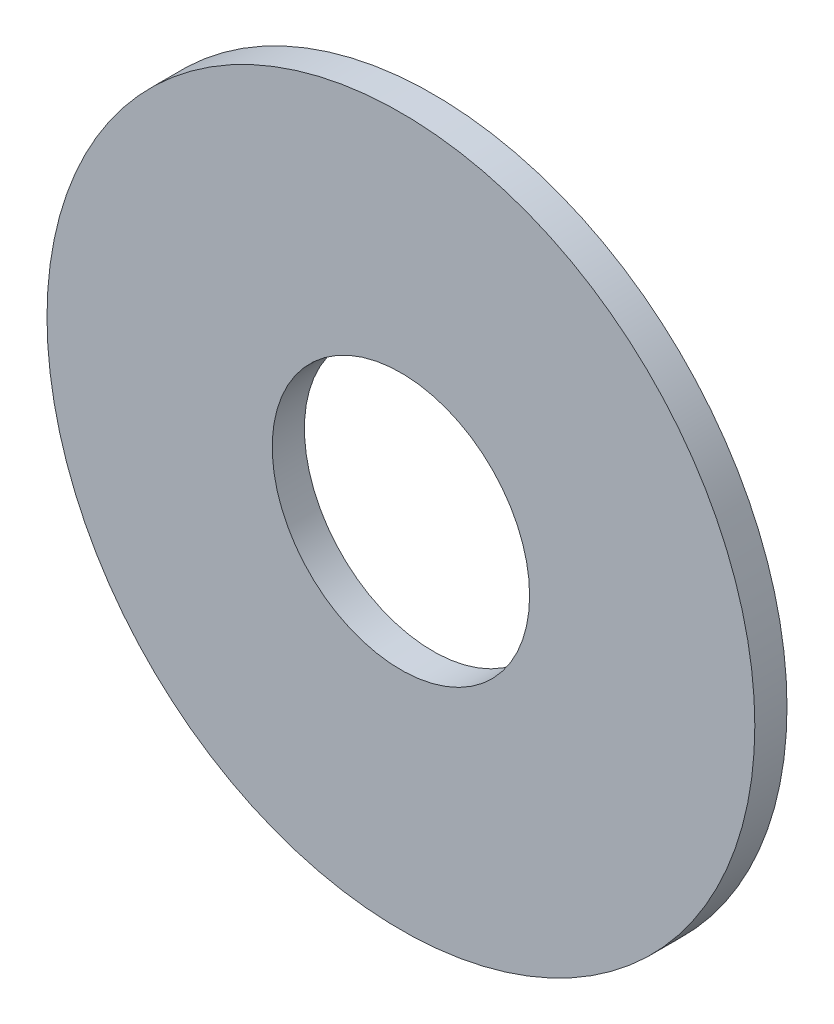
ISO-10303-21;
HEADER;
FILE_DESCRIPTION(('STEP AP214'),'2;1');
FILE_NAME('part.step','',(''),(''),'','','');
FILE_SCHEMA(('AUTOMOTIVE_DESIGN { 1 0 10303 214 1 1 1 1 }'));
ENDSEC;
DATA;
#1=APPLICATION_CONTEXT('core data for automotive mechanical design processes');
#2=APPLICATION_PROTOCOL_DEFINITION('international standard','automotive_design',2000,#1);
#3=PRODUCT_CONTEXT('',#1,'mechanical');
#4=PRODUCT('Part','Part','',(#3));
#5=PRODUCT_RELATED_PRODUCT_CATEGORY('part','',(#4));
#6=PRODUCT_DEFINITION_FORMATION('','',#4);
#7=PRODUCT_DEFINITION_CONTEXT('part definition',#1,'design');
#8=PRODUCT_DEFINITION('design','',#6,#7);
#9=PRODUCT_DEFINITION_SHAPE('','',#8);
#10=(LENGTH_UNIT() NAMED_UNIT(*) SI_UNIT(.MILLI.,.METRE.));
#11=(NAMED_UNIT(*) PLANE_ANGLE_UNIT() SI_UNIT($,.RADIAN.));
#12=(NAMED_UNIT(*) SI_UNIT($,.STERADIAN.) SOLID_ANGLE_UNIT());
#13=UNCERTAINTY_MEASURE_WITH_UNIT(LENGTH_MEASURE(1.E-05),#10,'distance_accuracy_value','');
#14=(GEOMETRIC_REPRESENTATION_CONTEXT(3) GLOBAL_UNCERTAINTY_ASSIGNED_CONTEXT((#13)) GLOBAL_UNIT_ASSIGNED_CONTEXT((#10,
#11,#12)) REPRESENTATION_CONTEXT('',''));
#15=CARTESIAN_POINT('',(0.,0.,0.));
#16=DIRECTION('',(0.,0.,1.));
#17=DIRECTION('',(1.,0.,0.));
#18=AXIS2_PLACEMENT_3D('',#15,#16,#17);
#19=CARTESIAN_POINT('',(0.,0.,1.));
#20=DIRECTION('',(0.,0.,1.));
#21=DIRECTION('',(1.,0.,0.));
#22=AXIS2_PLACEMENT_3D('',#19,#20,#21);
#23=PLANE('',#22);
#24=CARTESIAN_POINT('',(0.,0.,1.));
#25=DIRECTION('',(0.,0.,1.));
#26=DIRECTION('',(1.,0.,0.));
#27=AXIS2_PLACEMENT_3D('',#24,#25,#26);
#28=CIRCLE('',#27,11.);
#29=CARTESIAN_POINT('',(11.,0.,1.));
#30=VERTEX_POINT('',#29);
#31=EDGE_CURVE('E10',#30,#30,#28,.T.);
#32=ORIENTED_EDGE('',*,*,#31,.T.);
#33=EDGE_LOOP('',(#32));
#34=FACE_BOUND('',#33,.T.);
#35=CARTESIAN_POINT('',(0.,0.,1.));
#36=DIRECTION('',(0.,0.,1.));
#37=DIRECTION('',(1.,0.,0.));
#38=AXIS2_PLACEMENT_3D('',#35,#36,#37);
#39=CIRCLE('',#38,4.);
#40=CARTESIAN_POINT('',(4.,0.,1.));
#41=VERTEX_POINT('',#40);
#42=EDGE_CURVE('E39',#41,#41,#39,.T.);
#43=ORIENTED_EDGE('',*,*,#42,.F.);
#44=EDGE_LOOP('',(#43));
#45=FACE_BOUND('',#44,.T.);
#46=ADVANCED_FACE('F28',(#34,#45),#23,.T.);
#47=CARTESIAN_POINT('',(0.,0.,0.));
#48=DIRECTION('',(0.,0.,1.));
#49=DIRECTION('',(1.,0.,0.));
#50=AXIS2_PLACEMENT_3D('',#47,#48,#49);
#51=PLANE('',#50);
#52=CARTESIAN_POINT('',(0.,0.,0.));
#53=DIRECTION('',(0.,0.,1.));
#54=DIRECTION('',(1.,0.,0.));
#55=AXIS2_PLACEMENT_3D('',#52,#53,#54);
#56=CIRCLE('',#55,11.);
#57=CARTESIAN_POINT('',(11.,0.,0.));
#58=VERTEX_POINT('',#57);
#59=EDGE_CURVE('E32',#58,#58,#56,.T.);
#60=ORIENTED_EDGE('',*,*,#59,.F.);
#61=EDGE_LOOP('',(#60));
#62=FACE_BOUND('',#61,.T.);
#63=CARTESIAN_POINT('',(0.,0.,0.));
#64=DIRECTION('',(0.,0.,1.));
#65=DIRECTION('',(1.,0.,0.));
#66=AXIS2_PLACEMENT_3D('',#63,#64,#65);
#67=CIRCLE('',#66,4.);
#68=CARTESIAN_POINT('',(4.,0.,0.));
#69=VERTEX_POINT('',#68);
#70=EDGE_CURVE('E41',#69,#69,#67,.T.);
#71=ORIENTED_EDGE('',*,*,#70,.T.);
#72=EDGE_LOOP('',(#71));
#73=FACE_BOUND('',#72,.T.);
#74=ADVANCED_FACE('F51',(#62,#73),#51,.F.);
#75=CARTESIAN_POINT('',(0.,0.,1.));
#76=DIRECTION('',(0.,0.,-1.));
#77=DIRECTION('',(-1.,0.,0.));
#78=AXIS2_PLACEMENT_3D('',#75,#76,#77);
#79=CYLINDRICAL_SURFACE('',#78,11.);
#80=ORIENTED_EDGE('',*,*,#31,.F.);
#81=EDGE_LOOP('',(#80));
#82=FACE_BOUND('',#81,.T.);
#83=ORIENTED_EDGE('',*,*,#59,.T.);
#84=EDGE_LOOP('',(#83));
#85=FACE_BOUND('',#84,.T.);
#86=ADVANCED_FACE('F30',(#82,#85),#79,.T.);
#87=CARTESIAN_POINT('',(0.,0.,1.));
#88=DIRECTION('',(0.,0.,-1.));
#89=DIRECTION('',(-1.,0.,0.));
#90=AXIS2_PLACEMENT_3D('',#87,#88,#89);
#91=CYLINDRICAL_SURFACE('',#90,4.);
#92=ORIENTED_EDGE('',*,*,#42,.T.);
#93=EDGE_LOOP('',(#92));
#94=FACE_BOUND('',#93,.T.);
#95=ORIENTED_EDGE('',*,*,#70,.F.);
#96=EDGE_LOOP('',(#95));
#97=FACE_BOUND('',#96,.T.);
#98=ADVANCED_FACE('F47',(#94,#97),#91,.F.);
#99=CLOSED_SHELL('',(#46,#74,#86,#98));
#100=MANIFOLD_SOLID_BREP('B2',#99);
#101=ADVANCED_BREP_SHAPE_REPRESENTATION('',(#18,#100),#14);
#102=SHAPE_DEFINITION_REPRESENTATION(#9,#101);
ENDSEC;
END-ISO-10303-21;
